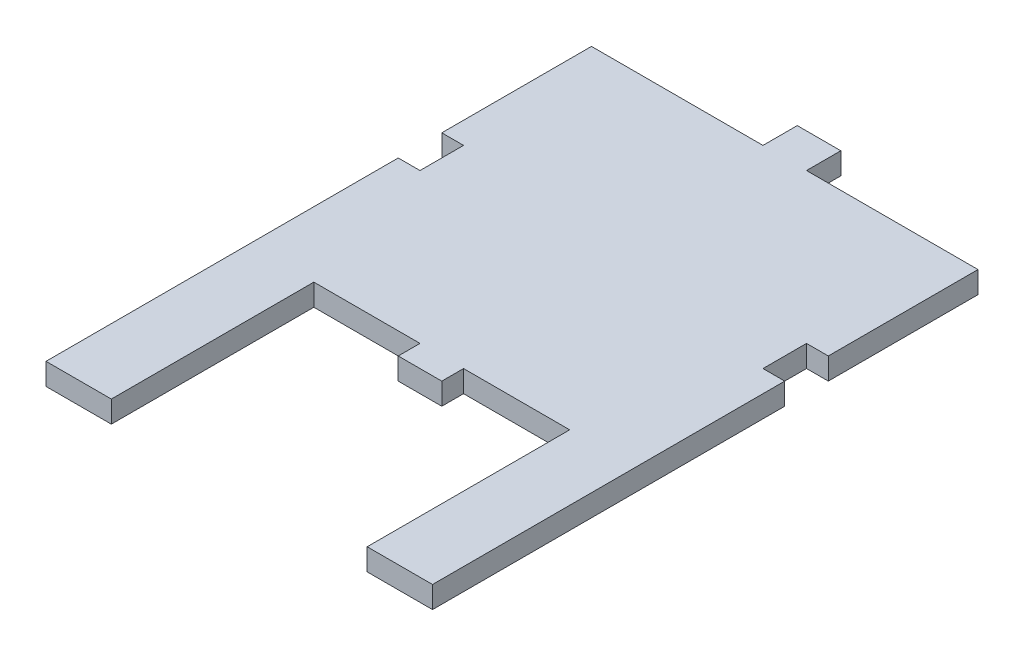
ISO-10303-21;
HEADER;
FILE_DESCRIPTION(('STEP AP214'),'2;1');
FILE_NAME('part.step','',(''),(''),'','','');
FILE_SCHEMA(('AUTOMOTIVE_DESIGN { 1 0 10303 214 1 1 1 1 }'));
ENDSEC;
DATA;
#1=APPLICATION_CONTEXT('core data for automotive mechanical design processes');
#2=APPLICATION_PROTOCOL_DEFINITION('international standard','automotive_design',2000,#1);
#3=PRODUCT_CONTEXT('',#1,'mechanical');
#4=PRODUCT('Part','Part','',(#3));
#5=PRODUCT_RELATED_PRODUCT_CATEGORY('part','',(#4));
#6=PRODUCT_DEFINITION_FORMATION('','',#4);
#7=PRODUCT_DEFINITION_CONTEXT('part definition',#1,'design');
#8=PRODUCT_DEFINITION('design','',#6,#7);
#9=PRODUCT_DEFINITION_SHAPE('','',#8);
#10=(LENGTH_UNIT() NAMED_UNIT(*) SI_UNIT(.MILLI.,.METRE.));
#11=(NAMED_UNIT(*) PLANE_ANGLE_UNIT() SI_UNIT($,.RADIAN.));
#12=(NAMED_UNIT(*) SI_UNIT($,.STERADIAN.) SOLID_ANGLE_UNIT());
#13=UNCERTAINTY_MEASURE_WITH_UNIT(LENGTH_MEASURE(1.E-05),#10,'distance_accuracy_value','');
#14=(GEOMETRIC_REPRESENTATION_CONTEXT(3) GLOBAL_UNCERTAINTY_ASSIGNED_CONTEXT((#13)) GLOBAL_UNIT_ASSIGNED_CONTEXT((#10,
#11,#12)) REPRESENTATION_CONTEXT('',''));
#15=CARTESIAN_POINT('',(0.,0.,0.));
#16=DIRECTION('',(0.,0.,1.));
#17=DIRECTION('',(1.,0.,0.));
#18=AXIS2_PLACEMENT_3D('',#15,#16,#17);
#19=CARTESIAN_POINT('',(-56.35,6.35,-50.));
#20=DIRECTION('',(0.,0.,1.));
#21=DIRECTION('',(1.,0.,0.));
#22=AXIS2_PLACEMENT_3D('',#19,#20,#21);
#23=PLANE('',#22);
#24=DIRECTION('',(0.,-1.,0.));
#25=VECTOR('',#24,1.);
#26=CARTESIAN_POINT('',(6.35000000000001,0.,-50.));
#27=LINE('',#26,#25);
#28=CARTESIAN_POINT('',(6.35,6.35,-50.));
#29=VERTEX_POINT('',#28);
#30=CARTESIAN_POINT('',(6.35,0.,-50.));
#31=VERTEX_POINT('',#30);
#32=EDGE_CURVE('E50',#29,#31,#27,.T.);
#33=ORIENTED_EDGE('',*,*,#32,.F.);
#34=DIRECTION('',(-1.,0.,0.));
#35=VECTOR('',#34,1.);
#36=CARTESIAN_POINT('',(-56.35,6.35,-50.));
#37=LINE('',#36,#35);
#38=CARTESIAN_POINT('',(56.35,6.35,-50.));
#39=VERTEX_POINT('',#38);
#40=EDGE_CURVE('E371',#39,#29,#37,.T.);
#41=ORIENTED_EDGE('',*,*,#40,.F.);
#42=DIRECTION('',(0.,-1.,0.));
#43=VECTOR('',#42,1.);
#44=CARTESIAN_POINT('',(56.35,6.35,-50.));
#45=LINE('',#44,#43);
#46=CARTESIAN_POINT('',(56.35,0.,-50.));
#47=VERTEX_POINT('',#46);
#48=EDGE_CURVE('E11',#39,#47,#45,.T.);
#49=ORIENTED_EDGE('',*,*,#48,.T.);
#50=DIRECTION('',(-1.,0.,0.));
#51=VECTOR('',#50,1.);
#52=CARTESIAN_POINT('',(-56.35,0.,-50.));
#53=LINE('',#52,#51);
#54=EDGE_CURVE('E342',#47,#31,#53,.T.);
#55=ORIENTED_EDGE('',*,*,#54,.T.);
#56=EDGE_LOOP('',(#33,#41,#49,#55));
#57=FACE_BOUND('',#56,.T.);
#58=ADVANCED_FACE('F33',(#57),#23,.F.);
#59=DIRECTION('',(0.,1.,0.));
#60=VECTOR('',#59,1.);
#61=CARTESIAN_POINT('',(-6.34999999999999,0.,-50.));
#62=LINE('',#61,#60);
#63=CARTESIAN_POINT('',(-6.34999999999999,0.,-50.));
#64=VERTEX_POINT('',#63);
#65=CARTESIAN_POINT('',(-6.34999999999999,6.35,-50.));
#66=VERTEX_POINT('',#65);
#67=EDGE_CURVE('E58',#64,#66,#62,.T.);
#68=ORIENTED_EDGE('',*,*,#67,.F.);
#69=CARTESIAN_POINT('',(-56.35,0.,-50.));
#70=VERTEX_POINT('',#69);
#71=EDGE_CURVE('E220',#64,#70,#53,.T.);
#72=ORIENTED_EDGE('',*,*,#71,.T.);
#73=DIRECTION('',(0.,-1.,0.));
#74=VECTOR('',#73,1.);
#75=CARTESIAN_POINT('',(-56.35,6.35,-50.));
#76=LINE('',#75,#74);
#77=CARTESIAN_POINT('',(-56.35,6.35,-50.));
#78=VERTEX_POINT('',#77);
#79=EDGE_CURVE('E42',#78,#70,#76,.T.);
#80=ORIENTED_EDGE('',*,*,#79,.F.);
#81=EDGE_CURVE('E369',#66,#78,#37,.T.);
#82=ORIENTED_EDGE('',*,*,#81,.F.);
#83=EDGE_LOOP('',(#68,#72,#80,#82));
#84=FACE_BOUND('',#83,.T.);
#85=ADVANCED_FACE('F406',(#84),#23,.F.);
#86=CARTESIAN_POINT('',(-56.35,6.35,50.));
#87=DIRECTION('',(0.,0.,-1.));
#88=DIRECTION('',(-1.,0.,0.));
#89=AXIS2_PLACEMENT_3D('',#86,#87,#88);
#90=PLANE('',#89);
#91=DIRECTION('',(0.,1.,0.));
#92=VECTOR('',#91,1.);
#93=CARTESIAN_POINT('',(-37.3,6.35,50.));
#94=LINE('',#93,#92);
#95=CARTESIAN_POINT('',(-37.3,0.,50.));
#96=VERTEX_POINT('',#95);
#97=CARTESIAN_POINT('',(-37.3,6.35,50.));
#98=VERTEX_POINT('',#97);
#99=EDGE_CURVE('E257',#96,#98,#94,.T.);
#100=ORIENTED_EDGE('',*,*,#99,.F.);
#101=DIRECTION('',(1.,0.,0.));
#102=VECTOR('',#101,1.);
#103=CARTESIAN_POINT('',(-56.35,0.,50.));
#104=LINE('',#103,#102);
#105=CARTESIAN_POINT('',(-6.34999999999999,0.,50.));
#106=VERTEX_POINT('',#105);
#107=EDGE_CURVE('E321',#96,#106,#104,.T.);
#108=ORIENTED_EDGE('',*,*,#107,.T.);
#109=DIRECTION('',(0.,-1.,0.));
#110=VECTOR('',#109,1.);
#111=CARTESIAN_POINT('',(-6.34999999999999,0.,50.));
#112=LINE('',#111,#110);
#113=CARTESIAN_POINT('',(-6.34999999999999,6.35,50.));
#114=VERTEX_POINT('',#113);
#115=EDGE_CURVE('E281',#114,#106,#112,.T.);
#116=ORIENTED_EDGE('',*,*,#115,.F.);
#117=DIRECTION('',(1.,0.,0.));
#118=VECTOR('',#117,1.);
#119=CARTESIAN_POINT('',(-56.35,6.35,50.));
#120=LINE('',#119,#118);
#121=EDGE_CURVE('E326',#98,#114,#120,.T.);
#122=ORIENTED_EDGE('',*,*,#121,.F.);
#123=EDGE_LOOP('',(#100,#108,#116,#122));
#124=FACE_BOUND('',#123,.T.);
#125=ADVANCED_FACE('F411',(#124),#90,.F.);
#126=CARTESIAN_POINT('',(6.35,0.,50.));
#127=VERTEX_POINT('',#126);
#128=CARTESIAN_POINT('',(37.3,0.,50.));
#129=VERTEX_POINT('',#128);
#130=EDGE_CURVE('E325',#127,#129,#104,.T.);
#131=ORIENTED_EDGE('',*,*,#130,.T.);
#132=DIRECTION('',(0.,1.,0.));
#133=VECTOR('',#132,1.);
#134=CARTESIAN_POINT('',(37.3,6.35,50.));
#135=LINE('',#134,#133);
#136=CARTESIAN_POINT('',(37.3,6.35,50.));
#137=VERTEX_POINT('',#136);
#138=EDGE_CURVE('E221',#129,#137,#135,.T.);
#139=ORIENTED_EDGE('',*,*,#138,.T.);
#140=CARTESIAN_POINT('',(6.35000000000001,6.35,50.));
#141=VERTEX_POINT('',#140);
#142=EDGE_CURVE('E296',#141,#137,#120,.T.);
#143=ORIENTED_EDGE('',*,*,#142,.F.);
#144=DIRECTION('',(0.,1.,0.));
#145=VECTOR('',#144,1.);
#146=CARTESIAN_POINT('',(6.35000000000001,0.,50.));
#147=LINE('',#146,#145);
#148=EDGE_CURVE('E276',#127,#141,#147,.T.);
#149=ORIENTED_EDGE('',*,*,#148,.F.);
#150=EDGE_LOOP('',(#131,#139,#143,#149));
#151=FACE_BOUND('',#150,.T.);
#152=ADVANCED_FACE('F420',(#151),#90,.F.);
#153=CARTESIAN_POINT('',(0.,6.35,0.));
#154=DIRECTION('',(0.,-1.,0.));
#155=DIRECTION('',(0.,0.,-1.));
#156=AXIS2_PLACEMENT_3D('',#153,#154,#155);
#157=PLANE('',#156);
#158=DIRECTION('',(-1.,0.,0.));
#159=VECTOR('',#158,1.);
#160=CARTESIAN_POINT('',(-50.,6.35,6.35));
#161=LINE('',#160,#159);
#162=CARTESIAN_POINT('',(-50.,6.35,6.35));
#163=VERTEX_POINT('',#162);
#164=CARTESIAN_POINT('',(-56.35,6.35,6.35));
#165=VERTEX_POINT('',#164);
#166=EDGE_CURVE('E521',#163,#165,#161,.T.);
#167=ORIENTED_EDGE('',*,*,#166,.T.);
#168=DIRECTION('',(0.,0.,1.));
#169=VECTOR('',#168,1.);
#170=CARTESIAN_POINT('',(-56.35,6.35,50.));
#171=LINE('',#170,#169);
#172=CARTESIAN_POINT('',(-56.35,6.35,109.05));
#173=VERTEX_POINT('',#172);
#174=EDGE_CURVE('E362',#165,#173,#171,.T.);
#175=ORIENTED_EDGE('',*,*,#174,.T.);
#176=DIRECTION('',(-1.,0.,0.));
#177=VECTOR('',#176,1.);
#178=CARTESIAN_POINT('',(-56.35,6.35,109.05));
#179=LINE('',#178,#177);
#180=CARTESIAN_POINT('',(-37.3,6.35,109.05));
#181=VERTEX_POINT('',#180);
#182=EDGE_CURVE('E265',#181,#173,#179,.T.);
#183=ORIENTED_EDGE('',*,*,#182,.F.);
#184=DIRECTION('',(0.,0.,-1.));
#185=VECTOR('',#184,1.);
#186=CARTESIAN_POINT('',(-37.3,6.35,109.05));
#187=LINE('',#186,#185);
#188=EDGE_CURVE('E268',#181,#98,#187,.T.);
#189=ORIENTED_EDGE('',*,*,#188,.T.);
#190=ORIENTED_EDGE('',*,*,#121,.T.);
#191=DIRECTION('',(0.,0.,-1.));
#192=VECTOR('',#191,1.);
#193=CARTESIAN_POINT('',(-6.34999999999999,6.35,56.35));
#194=LINE('',#193,#192);
#195=CARTESIAN_POINT('',(-6.34999999999999,6.35,56.35));
#196=VERTEX_POINT('',#195);
#197=EDGE_CURVE('E303',#196,#114,#194,.T.);
#198=ORIENTED_EDGE('',*,*,#197,.F.);
#199=DIRECTION('',(-1.,0.,0.));
#200=VECTOR('',#199,1.);
#201=CARTESIAN_POINT('',(-6.34999999999999,6.35,56.35));
#202=LINE('',#201,#200);
#203=CARTESIAN_POINT('',(6.35000000000001,6.35,56.35));
#204=VERTEX_POINT('',#203);
#205=EDGE_CURVE('E283',#204,#196,#202,.T.);
#206=ORIENTED_EDGE('',*,*,#205,.F.);
#207=DIRECTION('',(0.,0.,-1.));
#208=VECTOR('',#207,1.);
#209=CARTESIAN_POINT('',(6.35000000000001,6.35,56.35));
#210=LINE('',#209,#208);
#211=EDGE_CURVE('E299',#204,#141,#210,.T.);
#212=ORIENTED_EDGE('',*,*,#211,.T.);
#213=ORIENTED_EDGE('',*,*,#142,.T.);
#214=DIRECTION('',(0.,0.,-1.));
#215=VECTOR('',#214,1.);
#216=CARTESIAN_POINT('',(37.3,6.35,109.05));
#217=LINE('',#216,#215);
#218=CARTESIAN_POINT('',(37.3,6.35,109.05));
#219=VERTEX_POINT('',#218);
#220=EDGE_CURVE('E255',#219,#137,#217,.T.);
#221=ORIENTED_EDGE('',*,*,#220,.F.);
#222=DIRECTION('',(1.,0.,0.));
#223=VECTOR('',#222,1.);
#224=CARTESIAN_POINT('',(56.35,6.35,109.05));
#225=LINE('',#224,#223);
#226=CARTESIAN_POINT('',(56.35,6.35,109.05));
#227=VERTEX_POINT('',#226);
#228=EDGE_CURVE('E244',#219,#227,#225,.T.);
#229=ORIENTED_EDGE('',*,*,#228,.T.);
#230=DIRECTION('',(0.,0.,-1.));
#231=VECTOR('',#230,1.);
#232=CARTESIAN_POINT('',(56.35,6.35,50.));
#233=LINE('',#232,#231);
#234=CARTESIAN_POINT('',(56.35,6.35,6.35));
#235=VERTEX_POINT('',#234);
#236=EDGE_CURVE('E365',#227,#235,#233,.T.);
#237=ORIENTED_EDGE('',*,*,#236,.T.);
#238=DIRECTION('',(1.,0.,0.));
#239=VECTOR('',#238,1.);
#240=CARTESIAN_POINT('',(50.,6.35,6.35));
#241=LINE('',#240,#239);
#242=CARTESIAN_POINT('',(50.,6.35,6.35));
#243=VERTEX_POINT('',#242);
#244=EDGE_CURVE('E504',#243,#235,#241,.T.);
#245=ORIENTED_EDGE('',*,*,#244,.F.);
#246=DIRECTION('',(0.,0.,1.));
#247=VECTOR('',#246,1.);
#248=CARTESIAN_POINT('',(50.,6.35,-6.35));
#249=LINE('',#248,#247);
#250=CARTESIAN_POINT('',(50.,6.35,-6.35));
#251=VERTEX_POINT('',#250);
#252=EDGE_CURVE('E506',#251,#243,#249,.T.);
#253=ORIENTED_EDGE('',*,*,#252,.F.);
#254=DIRECTION('',(1.,0.,0.));
#255=VECTOR('',#254,1.);
#256=CARTESIAN_POINT('',(50.,6.35,-6.35));
#257=LINE('',#256,#255);
#258=CARTESIAN_POINT('',(56.35,6.35,-6.35));
#259=VERTEX_POINT('',#258);
#260=EDGE_CURVE('E384',#251,#259,#257,.T.);
#261=ORIENTED_EDGE('',*,*,#260,.T.);
#262=EDGE_CURVE('E324',#259,#39,#233,.T.);
#263=ORIENTED_EDGE('',*,*,#262,.T.);
#264=ORIENTED_EDGE('',*,*,#40,.T.);
#265=DIRECTION('',(0.,0.,1.));
#266=VECTOR('',#265,1.);
#267=CARTESIAN_POINT('',(6.35000000000001,6.35,-60.));
#268=LINE('',#267,#266);
#269=CARTESIAN_POINT('',(6.35000000000001,6.35,-60.));
#270=VERTEX_POINT('',#269);
#271=EDGE_CURVE('E226',#270,#29,#268,.T.);
#272=ORIENTED_EDGE('',*,*,#271,.F.);
#273=DIRECTION('',(1.,0.,0.));
#274=VECTOR('',#273,1.);
#275=CARTESIAN_POINT('',(6.35000000000001,6.35,-60.));
#276=LINE('',#275,#274);
#277=CARTESIAN_POINT('',(-6.34999999999999,6.35,-60.));
#278=VERTEX_POINT('',#277);
#279=EDGE_CURVE('E206',#278,#270,#276,.T.);
#280=ORIENTED_EDGE('',*,*,#279,.F.);
#281=DIRECTION('',(0.,0.,1.));
#282=VECTOR('',#281,1.);
#283=CARTESIAN_POINT('',(-6.34999999999999,6.35,-60.));
#284=LINE('',#283,#282);
#285=EDGE_CURVE('E203',#278,#66,#284,.T.);
#286=ORIENTED_EDGE('',*,*,#285,.T.);
#287=ORIENTED_EDGE('',*,*,#81,.T.);
#288=CARTESIAN_POINT('',(-56.35,6.35,-6.35));
#289=VERTEX_POINT('',#288);
#290=EDGE_CURVE('E358',#78,#289,#171,.T.);
#291=ORIENTED_EDGE('',*,*,#290,.T.);
#292=DIRECTION('',(-1.,0.,0.));
#293=VECTOR('',#292,1.);
#294=CARTESIAN_POINT('',(-50.,6.35,-6.35));
#295=LINE('',#294,#293);
#296=CARTESIAN_POINT('',(-50.,6.35,-6.35));
#297=VERTEX_POINT('',#296);
#298=EDGE_CURVE('E524',#297,#289,#295,.T.);
#299=ORIENTED_EDGE('',*,*,#298,.F.);
#300=DIRECTION('',(0.,0.,-1.));
#301=VECTOR('',#300,1.);
#302=CARTESIAN_POINT('',(-50.,6.35,6.35));
#303=LINE('',#302,#301);
#304=EDGE_CURVE('E308',#163,#297,#303,.T.);
#305=ORIENTED_EDGE('',*,*,#304,.F.);
#306=EDGE_LOOP('',(#167,#175,#183,#189,#190,#198,#206,#212,#213,#221,#229,#237,#245,#253,#261,
#263,#264,#272,#280,#286,#287,#291,#299,#305));
#307=FACE_BOUND('',#306,.T.);
#308=ADVANCED_FACE('F381',(#307),#157,.F.);
#309=CARTESIAN_POINT('',(0.,0.,0.));
#310=DIRECTION('',(0.,-1.,0.));
#311=DIRECTION('',(0.,0.,-1.));
#312=AXIS2_PLACEMENT_3D('',#309,#310,#311);
#313=PLANE('',#312);
#314=DIRECTION('',(0.,0.,1.));
#315=VECTOR('',#314,1.);
#316=CARTESIAN_POINT('',(-56.35,0.,50.));
#317=LINE('',#316,#315);
#318=CARTESIAN_POINT('',(-56.35,0.,6.35));
#319=VERTEX_POINT('',#318);
#320=CARTESIAN_POINT('',(-56.35,0.,109.05));
#321=VERTEX_POINT('',#320);
#322=EDGE_CURVE('E338',#319,#321,#317,.T.);
#323=ORIENTED_EDGE('',*,*,#322,.F.);
#324=DIRECTION('',(-1.,0.,0.));
#325=VECTOR('',#324,1.);
#326=CARTESIAN_POINT('',(-50.,0.,6.35));
#327=LINE('',#326,#325);
#328=CARTESIAN_POINT('',(-50.,0.,6.35));
#329=VERTEX_POINT('',#328);
#330=EDGE_CURVE('E516',#329,#319,#327,.T.);
#331=ORIENTED_EDGE('',*,*,#330,.F.);
#332=DIRECTION('',(0.,0.,-1.));
#333=VECTOR('',#332,1.);
#334=CARTESIAN_POINT('',(-50.,0.,6.35));
#335=LINE('',#334,#333);
#336=CARTESIAN_POINT('',(-50.,0.,-6.35));
#337=VERTEX_POINT('',#336);
#338=EDGE_CURVE('E523',#329,#337,#335,.T.);
#339=ORIENTED_EDGE('',*,*,#338,.T.);
#340=DIRECTION('',(-1.,0.,0.));
#341=VECTOR('',#340,1.);
#342=CARTESIAN_POINT('',(-50.,0.,-6.35));
#343=LINE('',#342,#341);
#344=CARTESIAN_POINT('',(-56.35,0.,-6.35));
#345=VERTEX_POINT('',#344);
#346=EDGE_CURVE('E529',#337,#345,#343,.T.);
#347=ORIENTED_EDGE('',*,*,#346,.T.);
#348=EDGE_CURVE('E331',#70,#345,#317,.T.);
#349=ORIENTED_EDGE('',*,*,#348,.F.);
#350=ORIENTED_EDGE('',*,*,#71,.F.);
#351=DIRECTION('',(0.,0.,1.));
#352=VECTOR('',#351,1.);
#353=CARTESIAN_POINT('',(-6.34999999999999,0.,-60.));
#354=LINE('',#353,#352);
#355=CARTESIAN_POINT('',(-6.34999999999999,0.,-60.));
#356=VERTEX_POINT('',#355);
#357=EDGE_CURVE('E201',#356,#64,#354,.T.);
#358=ORIENTED_EDGE('',*,*,#357,.F.);
#359=DIRECTION('',(-1.,0.,0.));
#360=VECTOR('',#359,1.);
#361=CARTESIAN_POINT('',(6.35000000000001,0.,-60.));
#362=LINE('',#361,#360);
#363=CARTESIAN_POINT('',(6.35000000000001,0.,-60.));
#364=VERTEX_POINT('',#363);
#365=EDGE_CURVE('E207',#364,#356,#362,.T.);
#366=ORIENTED_EDGE('',*,*,#365,.F.);
#367=DIRECTION('',(0.,0.,1.));
#368=VECTOR('',#367,1.);
#369=CARTESIAN_POINT('',(6.35000000000001,0.,-60.));
#370=LINE('',#369,#368);
#371=EDGE_CURVE('E235',#364,#31,#370,.T.);
#372=ORIENTED_EDGE('',*,*,#371,.T.);
#373=ORIENTED_EDGE('',*,*,#54,.F.);
#374=DIRECTION('',(0.,0.,-1.));
#375=VECTOR('',#374,1.);
#376=CARTESIAN_POINT('',(56.35,0.,50.));
#377=LINE('',#376,#375);
#378=CARTESIAN_POINT('',(56.35,0.,-6.35));
#379=VERTEX_POINT('',#378);
#380=EDGE_CURVE('E355',#379,#47,#377,.T.);
#381=ORIENTED_EDGE('',*,*,#380,.F.);
#382=DIRECTION('',(1.,0.,0.));
#383=VECTOR('',#382,1.);
#384=CARTESIAN_POINT('',(50.,0.,-6.35));
#385=LINE('',#384,#383);
#386=CARTESIAN_POINT('',(50.,0.,-6.35));
#387=VERTEX_POINT('',#386);
#388=EDGE_CURVE('E499',#387,#379,#385,.T.);
#389=ORIENTED_EDGE('',*,*,#388,.F.);
#390=DIRECTION('',(0.,0.,1.));
#391=VECTOR('',#390,1.);
#392=CARTESIAN_POINT('',(50.,0.,-6.35));
#393=LINE('',#392,#391);
#394=CARTESIAN_POINT('',(50.,0.,6.35));
#395=VERTEX_POINT('',#394);
#396=EDGE_CURVE('E503',#387,#395,#393,.T.);
#397=ORIENTED_EDGE('',*,*,#396,.T.);
#398=DIRECTION('',(1.,0.,0.));
#399=VECTOR('',#398,1.);
#400=CARTESIAN_POINT('',(50.,0.,6.35));
#401=LINE('',#400,#399);
#402=CARTESIAN_POINT('',(56.35,0.,6.35));
#403=VERTEX_POINT('',#402);
#404=EDGE_CURVE('E493',#395,#403,#401,.T.);
#405=ORIENTED_EDGE('',*,*,#404,.T.);
#406=CARTESIAN_POINT('',(56.35,0.,109.05));
#407=VERTEX_POINT('',#406);
#408=EDGE_CURVE('E348',#407,#403,#377,.T.);
#409=ORIENTED_EDGE('',*,*,#408,.F.);
#410=DIRECTION('',(-1.,0.,0.));
#411=VECTOR('',#410,1.);
#412=CARTESIAN_POINT('',(56.35,0.,109.05));
#413=LINE('',#412,#411);
#414=CARTESIAN_POINT('',(37.3,0.,109.05));
#415=VERTEX_POINT('',#414);
#416=EDGE_CURVE('E250',#407,#415,#413,.T.);
#417=ORIENTED_EDGE('',*,*,#416,.T.);
#418=DIRECTION('',(0.,0.,-1.));
#419=VECTOR('',#418,1.);
#420=CARTESIAN_POINT('',(37.3,0.,109.05));
#421=LINE('',#420,#419);
#422=EDGE_CURVE('E252',#415,#129,#421,.T.);
#423=ORIENTED_EDGE('',*,*,#422,.T.);
#424=ORIENTED_EDGE('',*,*,#130,.F.);
#425=DIRECTION('',(0.,0.,-1.));
#426=VECTOR('',#425,1.);
#427=CARTESIAN_POINT('',(6.35000000000001,0.,56.35));
#428=LINE('',#427,#426);
#429=CARTESIAN_POINT('',(6.35000000000001,0.,56.35));
#430=VERTEX_POINT('',#429);
#431=EDGE_CURVE('E302',#430,#127,#428,.T.);
#432=ORIENTED_EDGE('',*,*,#431,.F.);
#433=DIRECTION('',(1.,0.,0.));
#434=VECTOR('',#433,1.);
#435=CARTESIAN_POINT('',(-6.34999999999999,0.,56.35));
#436=LINE('',#435,#434);
#437=CARTESIAN_POINT('',(-6.34999999999999,0.,56.35));
#438=VERTEX_POINT('',#437);
#439=EDGE_CURVE('E277',#438,#430,#436,.T.);
#440=ORIENTED_EDGE('',*,*,#439,.F.);
#441=DIRECTION('',(0.,0.,-1.));
#442=VECTOR('',#441,1.);
#443=CARTESIAN_POINT('',(-6.34999999999999,0.,56.35));
#444=LINE('',#443,#442);
#445=EDGE_CURVE('E287',#438,#106,#444,.T.);
#446=ORIENTED_EDGE('',*,*,#445,.T.);
#447=ORIENTED_EDGE('',*,*,#107,.F.);
#448=DIRECTION('',(0.,0.,-1.));
#449=VECTOR('',#448,1.);
#450=CARTESIAN_POINT('',(-37.3,0.,109.05));
#451=LINE('',#450,#449);
#452=CARTESIAN_POINT('',(-37.3,0.,109.05));
#453=VERTEX_POINT('',#452);
#454=EDGE_CURVE('E273',#453,#96,#451,.T.);
#455=ORIENTED_EDGE('',*,*,#454,.F.);
#456=DIRECTION('',(1.,0.,0.));
#457=VECTOR('',#456,1.);
#458=CARTESIAN_POINT('',(-56.35,0.,109.05));
#459=LINE('',#458,#457);
#460=EDGE_CURVE('E261',#321,#453,#459,.T.);
#461=ORIENTED_EDGE('',*,*,#460,.F.);
#462=EDGE_LOOP('',(#323,#331,#339,#347,#349,#350,#358,#366,#372,#373,#381,#389,#397,#405,#409,
#417,#423,#424,#432,#440,#446,#447,#455,#461));
#463=FACE_BOUND('',#462,.T.);
#464=ADVANCED_FACE('F218',(#463),#313,.T.);
#465=CARTESIAN_POINT('',(-56.35,6.35,50.));
#466=DIRECTION('',(1.,0.,0.));
#467=DIRECTION('',(0.,0.,-1.));
#468=AXIS2_PLACEMENT_3D('',#465,#466,#467);
#469=PLANE('',#468);
#470=DIRECTION('',(0.,1.,0.));
#471=VECTOR('',#470,1.);
#472=CARTESIAN_POINT('',(-56.35,0.,6.35));
#473=LINE('',#472,#471);
#474=EDGE_CURVE('E518',#319,#165,#473,.T.);
#475=ORIENTED_EDGE('',*,*,#474,.F.);
#476=ORIENTED_EDGE('',*,*,#322,.T.);
#477=DIRECTION('',(0.,-1.,0.));
#478=VECTOR('',#477,1.);
#479=CARTESIAN_POINT('',(-56.35,6.35,109.05));
#480=LINE('',#479,#478);
#481=EDGE_CURVE('E258',#173,#321,#480,.T.);
#482=ORIENTED_EDGE('',*,*,#481,.F.);
#483=ORIENTED_EDGE('',*,*,#174,.F.);
#484=EDGE_LOOP('',(#475,#476,#482,#483));
#485=FACE_BOUND('',#484,.T.);
#486=ADVANCED_FACE('F417',(#485),#469,.F.);
#487=CARTESIAN_POINT('',(56.35,6.35,50.));
#488=DIRECTION('',(-1.,0.,0.));
#489=DIRECTION('',(0.,0.,1.));
#490=AXIS2_PLACEMENT_3D('',#487,#488,#489);
#491=PLANE('',#490);
#492=DIRECTION('',(0.,1.,0.));
#493=VECTOR('',#492,1.);
#494=CARTESIAN_POINT('',(56.35,0.,-6.35));
#495=LINE('',#494,#493);
#496=EDGE_CURVE('E390',#379,#259,#495,.T.);
#497=ORIENTED_EDGE('',*,*,#496,.F.);
#498=ORIENTED_EDGE('',*,*,#380,.T.);
#499=ORIENTED_EDGE('',*,*,#48,.F.);
#500=ORIENTED_EDGE('',*,*,#262,.F.);
#501=EDGE_LOOP('',(#497,#498,#499,#500));
#502=FACE_BOUND('',#501,.T.);
#503=ADVANCED_FACE('F388',(#502),#491,.F.);
#504=ORIENTED_EDGE('',*,*,#408,.T.);
#505=DIRECTION('',(0.,1.,0.));
#506=VECTOR('',#505,1.);
#507=CARTESIAN_POINT('',(56.35,0.,6.35));
#508=LINE('',#507,#506);
#509=EDGE_CURVE('E495',#403,#235,#508,.T.);
#510=ORIENTED_EDGE('',*,*,#509,.T.);
#511=ORIENTED_EDGE('',*,*,#236,.F.);
#512=DIRECTION('',(0.,-1.,0.));
#513=VECTOR('',#512,1.);
#514=CARTESIAN_POINT('',(56.35,6.35,109.05));
#515=LINE('',#514,#513);
#516=EDGE_CURVE('E224',#227,#407,#515,.T.);
#517=ORIENTED_EDGE('',*,*,#516,.T.);
#518=EDGE_LOOP('',(#504,#510,#511,#517));
#519=FACE_BOUND('',#518,.T.);
#520=ADVANCED_FACE('F35',(#519),#491,.F.);
#521=ORIENTED_EDGE('',*,*,#348,.T.);
#522=DIRECTION('',(0.,1.,0.));
#523=VECTOR('',#522,1.);
#524=CARTESIAN_POINT('',(-56.35,0.,-6.35));
#525=LINE('',#524,#523);
#526=EDGE_CURVE('E515',#345,#289,#525,.T.);
#527=ORIENTED_EDGE('',*,*,#526,.T.);
#528=ORIENTED_EDGE('',*,*,#290,.F.);
#529=ORIENTED_EDGE('',*,*,#79,.T.);
#530=EDGE_LOOP('',(#521,#527,#528,#529));
#531=FACE_BOUND('',#530,.T.);
#532=ADVANCED_FACE('F413',(#531),#469,.F.);
#533=CARTESIAN_POINT('',(50.,0.,-6.35));
#534=DIRECTION('',(-1.,0.,0.));
#535=DIRECTION('',(0.,0.,1.));
#536=AXIS2_PLACEMENT_3D('',#533,#534,#535);
#537=PLANE('',#536);
#538=ORIENTED_EDGE('',*,*,#252,.T.);
#539=DIRECTION('',(0.,1.,0.));
#540=VECTOR('',#539,1.);
#541=CARTESIAN_POINT('',(50.,0.,6.35));
#542=LINE('',#541,#540);
#543=EDGE_CURVE('E496',#395,#243,#542,.T.);
#544=ORIENTED_EDGE('',*,*,#543,.F.);
#545=ORIENTED_EDGE('',*,*,#396,.F.);
#546=DIRECTION('',(0.,1.,0.));
#547=VECTOR('',#546,1.);
#548=CARTESIAN_POINT('',(50.,0.,-6.35));
#549=LINE('',#548,#547);
#550=EDGE_CURVE('E392',#387,#251,#549,.T.);
#551=ORIENTED_EDGE('',*,*,#550,.T.);
#552=EDGE_LOOP('',(#538,#544,#545,#551));
#553=FACE_BOUND('',#552,.T.);
#554=ADVANCED_FACE('F416',(#553),#537,.F.);
#555=CARTESIAN_POINT('',(50.,0.,-6.35));
#556=DIRECTION('',(0.,0.,1.));
#557=DIRECTION('',(1.,0.,0.));
#558=AXIS2_PLACEMENT_3D('',#555,#556,#557);
#559=PLANE('',#558);
#560=ORIENTED_EDGE('',*,*,#260,.F.);
#561=ORIENTED_EDGE('',*,*,#550,.F.);
#562=ORIENTED_EDGE('',*,*,#388,.T.);
#563=ORIENTED_EDGE('',*,*,#496,.T.);
#564=EDGE_LOOP('',(#560,#561,#562,#563));
#565=FACE_BOUND('',#564,.T.);
#566=ADVANCED_FACE('F428',(#565),#559,.T.);
#567=CARTESIAN_POINT('',(50.,0.,6.35));
#568=DIRECTION('',(0.,0.,1.));
#569=DIRECTION('',(1.,0.,0.));
#570=AXIS2_PLACEMENT_3D('',#567,#568,#569);
#571=PLANE('',#570);
#572=ORIENTED_EDGE('',*,*,#244,.T.);
#573=ORIENTED_EDGE('',*,*,#509,.F.);
#574=ORIENTED_EDGE('',*,*,#404,.F.);
#575=ORIENTED_EDGE('',*,*,#543,.T.);
#576=EDGE_LOOP('',(#572,#573,#574,#575));
#577=FACE_BOUND('',#576,.T.);
#578=ADVANCED_FACE('F430',(#577),#571,.F.);
#579=CARTESIAN_POINT('',(-50.,0.,6.35));
#580=DIRECTION('',(1.,0.,0.));
#581=DIRECTION('',(0.,0.,-1.));
#582=AXIS2_PLACEMENT_3D('',#579,#580,#581);
#583=PLANE('',#582);
#584=ORIENTED_EDGE('',*,*,#304,.T.);
#585=DIRECTION('',(0.,1.,0.));
#586=VECTOR('',#585,1.);
#587=CARTESIAN_POINT('',(-50.,0.,-6.35));
#588=LINE('',#587,#586);
#589=EDGE_CURVE('E513',#337,#297,#588,.T.);
#590=ORIENTED_EDGE('',*,*,#589,.F.);
#591=ORIENTED_EDGE('',*,*,#338,.F.);
#592=DIRECTION('',(0.,1.,0.));
#593=VECTOR('',#592,1.);
#594=CARTESIAN_POINT('',(-50.,0.,6.35));
#595=LINE('',#594,#593);
#596=EDGE_CURVE('E509',#329,#163,#595,.T.);
#597=ORIENTED_EDGE('',*,*,#596,.T.);
#598=EDGE_LOOP('',(#584,#590,#591,#597));
#599=FACE_BOUND('',#598,.T.);
#600=ADVANCED_FACE('F433',(#599),#583,.F.);
#601=CARTESIAN_POINT('',(-50.,0.,6.35));
#602=DIRECTION('',(0.,0.,-1.));
#603=DIRECTION('',(-1.,0.,0.));
#604=AXIS2_PLACEMENT_3D('',#601,#602,#603);
#605=PLANE('',#604);
#606=ORIENTED_EDGE('',*,*,#166,.F.);
#607=ORIENTED_EDGE('',*,*,#596,.F.);
#608=ORIENTED_EDGE('',*,*,#330,.T.);
#609=ORIENTED_EDGE('',*,*,#474,.T.);
#610=EDGE_LOOP('',(#606,#607,#608,#609));
#611=FACE_BOUND('',#610,.T.);
#612=ADVANCED_FACE('F440',(#611),#605,.T.);
#613=CARTESIAN_POINT('',(-50.,0.,-6.35));
#614=DIRECTION('',(0.,0.,-1.));
#615=DIRECTION('',(-1.,0.,0.));
#616=AXIS2_PLACEMENT_3D('',#613,#614,#615);
#617=PLANE('',#616);
#618=ORIENTED_EDGE('',*,*,#298,.T.);
#619=ORIENTED_EDGE('',*,*,#526,.F.);
#620=ORIENTED_EDGE('',*,*,#346,.F.);
#621=ORIENTED_EDGE('',*,*,#589,.T.);
#622=EDGE_LOOP('',(#618,#619,#620,#621));
#623=FACE_BOUND('',#622,.T.);
#624=ADVANCED_FACE('F442',(#623),#617,.F.);
#625=CARTESIAN_POINT('',(6.35000000000001,0.,56.35));
#626=DIRECTION('',(-1.,0.,0.));
#627=DIRECTION('',(0.,0.,1.));
#628=AXIS2_PLACEMENT_3D('',#625,#626,#627);
#629=PLANE('',#628);
#630=ORIENTED_EDGE('',*,*,#148,.T.);
#631=ORIENTED_EDGE('',*,*,#211,.F.);
#632=DIRECTION('',(0.,1.,0.));
#633=VECTOR('',#632,1.);
#634=CARTESIAN_POINT('',(6.35000000000001,0.,56.35));
#635=LINE('',#634,#633);
#636=EDGE_CURVE('E280',#430,#204,#635,.T.);
#637=ORIENTED_EDGE('',*,*,#636,.F.);
#638=ORIENTED_EDGE('',*,*,#431,.T.);
#639=EDGE_LOOP('',(#630,#631,#637,#638));
#640=FACE_BOUND('',#639,.T.);
#641=ADVANCED_FACE('F445',(#640),#629,.F.);
#642=CARTESIAN_POINT('',(-6.34999999999999,0.,56.35));
#643=DIRECTION('',(1.,0.,0.));
#644=DIRECTION('',(0.,0.,-1.));
#645=AXIS2_PLACEMENT_3D('',#642,#643,#644);
#646=PLANE('',#645);
#647=ORIENTED_EDGE('',*,*,#115,.T.);
#648=ORIENTED_EDGE('',*,*,#445,.F.);
#649=DIRECTION('',(0.,-1.,0.));
#650=VECTOR('',#649,1.);
#651=CARTESIAN_POINT('',(-6.34999999999999,0.,56.35));
#652=LINE('',#651,#650);
#653=EDGE_CURVE('E285',#196,#438,#652,.T.);
#654=ORIENTED_EDGE('',*,*,#653,.F.);
#655=ORIENTED_EDGE('',*,*,#197,.T.);
#656=EDGE_LOOP('',(#647,#648,#654,#655));
#657=FACE_BOUND('',#656,.T.);
#658=ADVANCED_FACE('F452',(#657),#646,.F.);
#659=CARTESIAN_POINT('',(0.,0.,56.35));
#660=DIRECTION('',(0.,0.,1.));
#661=DIRECTION('',(1.,0.,0.));
#662=AXIS2_PLACEMENT_3D('',#659,#660,#661);
#663=PLANE('',#662);
#664=ORIENTED_EDGE('',*,*,#439,.T.);
#665=ORIENTED_EDGE('',*,*,#636,.T.);
#666=ORIENTED_EDGE('',*,*,#205,.T.);
#667=ORIENTED_EDGE('',*,*,#653,.T.);
#668=EDGE_LOOP('',(#664,#665,#666,#667));
#669=FACE_BOUND('',#668,.T.);
#670=ADVANCED_FACE('F456',(#669),#663,.T.);
#671=CARTESIAN_POINT('',(-37.3,6.35,109.05));
#672=DIRECTION('',(-1.,0.,0.));
#673=DIRECTION('',(0.,0.,1.));
#674=AXIS2_PLACEMENT_3D('',#671,#672,#673);
#675=PLANE('',#674);
#676=ORIENTED_EDGE('',*,*,#99,.T.);
#677=ORIENTED_EDGE('',*,*,#188,.F.);
#678=DIRECTION('',(0.,1.,0.));
#679=VECTOR('',#678,1.);
#680=CARTESIAN_POINT('',(-37.3,6.35,109.05));
#681=LINE('',#680,#679);
#682=EDGE_CURVE('E263',#453,#181,#681,.T.);
#683=ORIENTED_EDGE('',*,*,#682,.F.);
#684=ORIENTED_EDGE('',*,*,#454,.T.);
#685=EDGE_LOOP('',(#676,#677,#683,#684));
#686=FACE_BOUND('',#685,.T.);
#687=ADVANCED_FACE('F460',(#686),#675,.F.);
#688=CARTESIAN_POINT('',(0.,0.,109.05));
#689=DIRECTION('',(0.,0.,1.));
#690=DIRECTION('',(1.,0.,0.));
#691=AXIS2_PLACEMENT_3D('',#688,#689,#690);
#692=PLANE('',#691);
#693=ORIENTED_EDGE('',*,*,#481,.T.);
#694=ORIENTED_EDGE('',*,*,#460,.T.);
#695=ORIENTED_EDGE('',*,*,#682,.T.);
#696=ORIENTED_EDGE('',*,*,#182,.T.);
#697=EDGE_LOOP('',(#693,#694,#695,#696));
#698=FACE_BOUND('',#697,.T.);
#699=ADVANCED_FACE('F464',(#698),#692,.T.);
#700=CARTESIAN_POINT('',(37.3,6.35,109.05));
#701=DIRECTION('',(-1.,0.,0.));
#702=DIRECTION('',(0.,0.,1.));
#703=AXIS2_PLACEMENT_3D('',#700,#701,#702);
#704=PLANE('',#703);
#705=ORIENTED_EDGE('',*,*,#138,.F.);
#706=ORIENTED_EDGE('',*,*,#422,.F.);
#707=DIRECTION('',(0.,1.,0.));
#708=VECTOR('',#707,1.);
#709=CARTESIAN_POINT('',(37.3,6.35,109.05));
#710=LINE('',#709,#708);
#711=EDGE_CURVE('E247',#415,#219,#710,.T.);
#712=ORIENTED_EDGE('',*,*,#711,.T.);
#713=ORIENTED_EDGE('',*,*,#220,.T.);
#714=EDGE_LOOP('',(#705,#706,#712,#713));
#715=FACE_BOUND('',#714,.T.);
#716=ADVANCED_FACE('F468',(#715),#704,.T.);
#717=CARTESIAN_POINT('',(0.,0.,109.05));
#718=DIRECTION('',(0.,0.,1.));
#719=DIRECTION('',(-1.,0.,0.));
#720=AXIS2_PLACEMENT_3D('',#717,#718,#719);
#721=PLANE('',#720);
#722=ORIENTED_EDGE('',*,*,#516,.F.);
#723=ORIENTED_EDGE('',*,*,#228,.F.);
#724=ORIENTED_EDGE('',*,*,#711,.F.);
#725=ORIENTED_EDGE('',*,*,#416,.F.);
#726=EDGE_LOOP('',(#722,#723,#724,#725));
#727=FACE_BOUND('',#726,.T.);
#728=ADVANCED_FACE('F403',(#727),#721,.T.);
#729=CARTESIAN_POINT('',(-6.34999999999999,0.,-60.));
#730=DIRECTION('',(1.,0.,0.));
#731=DIRECTION('',(0.,0.,-1.));
#732=AXIS2_PLACEMENT_3D('',#729,#730,#731);
#733=PLANE('',#732);
#734=ORIENTED_EDGE('',*,*,#67,.T.);
#735=ORIENTED_EDGE('',*,*,#285,.F.);
#736=DIRECTION('',(0.,1.,0.));
#737=VECTOR('',#736,1.);
#738=CARTESIAN_POINT('',(-6.34999999999999,0.,-60.));
#739=LINE('',#738,#737);
#740=EDGE_CURVE('E197',#356,#278,#739,.T.);
#741=ORIENTED_EDGE('',*,*,#740,.F.);
#742=ORIENTED_EDGE('',*,*,#357,.T.);
#743=EDGE_LOOP('',(#734,#735,#741,#742));
#744=FACE_BOUND('',#743,.T.);
#745=ADVANCED_FACE('F199',(#744),#733,.F.);
#746=CARTESIAN_POINT('',(6.35000000000001,0.,-60.));
#747=DIRECTION('',(-1.,0.,0.));
#748=DIRECTION('',(0.,0.,1.));
#749=AXIS2_PLACEMENT_3D('',#746,#747,#748);
#750=PLANE('',#749);
#751=ORIENTED_EDGE('',*,*,#32,.T.);
#752=ORIENTED_EDGE('',*,*,#371,.F.);
#753=DIRECTION('',(0.,-1.,0.));
#754=VECTOR('',#753,1.);
#755=CARTESIAN_POINT('',(6.35000000000001,0.,-60.));
#756=LINE('',#755,#754);
#757=EDGE_CURVE('E212',#270,#364,#756,.T.);
#758=ORIENTED_EDGE('',*,*,#757,.F.);
#759=ORIENTED_EDGE('',*,*,#271,.T.);
#760=EDGE_LOOP('',(#751,#752,#758,#759));
#761=FACE_BOUND('',#760,.T.);
#762=ADVANCED_FACE('F395',(#761),#750,.F.);
#763=CARTESIAN_POINT('',(0.,0.,-60.));
#764=DIRECTION('',(0.,0.,-1.));
#765=DIRECTION('',(-1.,0.,0.));
#766=AXIS2_PLACEMENT_3D('',#763,#764,#765);
#767=PLANE('',#766);
#768=ORIENTED_EDGE('',*,*,#365,.T.);
#769=ORIENTED_EDGE('',*,*,#740,.T.);
#770=ORIENTED_EDGE('',*,*,#279,.T.);
#771=ORIENTED_EDGE('',*,*,#757,.T.);
#772=EDGE_LOOP('',(#768,#769,#770,#771));
#773=FACE_BOUND('',#772,.T.);
#774=ADVANCED_FACE('F210',(#773),#767,.T.);
#775=CLOSED_SHELL('',(#58,#85,#125,#152,#308,#464,#486,#503,#520,#532,#554,#566,#578,#600,#612,
#624,#641,#658,#670,#687,#699,#716,#728,#745,#762,#774));
#776=MANIFOLD_SOLID_BREP('B2',#775);
#777=ADVANCED_BREP_SHAPE_REPRESENTATION('',(#18,#776),#14);
#778=SHAPE_DEFINITION_REPRESENTATION(#9,#777);
ENDSEC;
END-ISO-10303-21;
